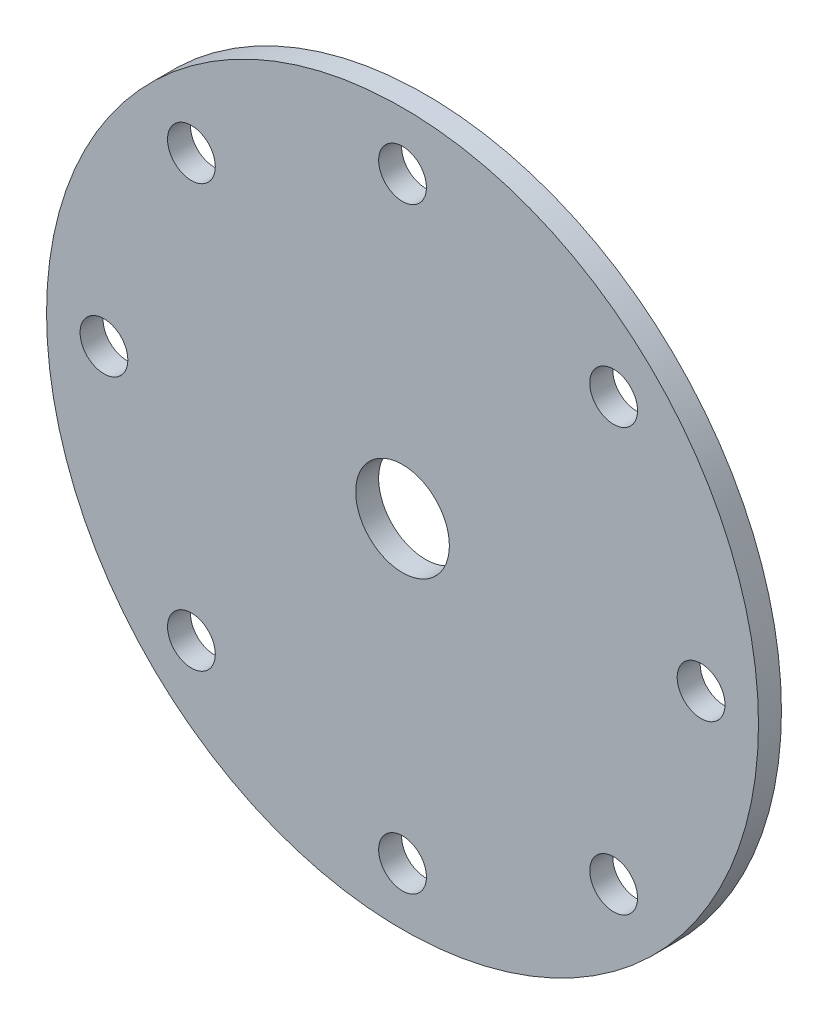
ISO-10303-21;
HEADER;
FILE_DESCRIPTION(('STEP AP214'),'2;1');
FILE_NAME('part.step','',(''),(''),'','','');
FILE_SCHEMA(('AUTOMOTIVE_DESIGN { 1 0 10303 214 1 1 1 1 }'));
ENDSEC;
DATA;
#1=APPLICATION_CONTEXT('core data for automotive mechanical design processes');
#2=APPLICATION_PROTOCOL_DEFINITION('international standard','automotive_design',2000,#1);
#3=PRODUCT_CONTEXT('',#1,'mechanical');
#4=PRODUCT('Part','Part','',(#3));
#5=PRODUCT_RELATED_PRODUCT_CATEGORY('part','',(#4));
#6=PRODUCT_DEFINITION_FORMATION('','',#4);
#7=PRODUCT_DEFINITION_CONTEXT('part definition',#1,'design');
#8=PRODUCT_DEFINITION('design','',#6,#7);
#9=PRODUCT_DEFINITION_SHAPE('','',#8);
#10=(LENGTH_UNIT() NAMED_UNIT(*) SI_UNIT(.MILLI.,.METRE.));
#11=(NAMED_UNIT(*) PLANE_ANGLE_UNIT() SI_UNIT($,.RADIAN.));
#12=(NAMED_UNIT(*) SI_UNIT($,.STERADIAN.) SOLID_ANGLE_UNIT());
#13=UNCERTAINTY_MEASURE_WITH_UNIT(LENGTH_MEASURE(1.E-05),#10,'distance_accuracy_value','');
#14=(GEOMETRIC_REPRESENTATION_CONTEXT(3) GLOBAL_UNCERTAINTY_ASSIGNED_CONTEXT((#13)) GLOBAL_UNIT_ASSIGNED_CONTEXT((#10,
#11,#12)) REPRESENTATION_CONTEXT('',''));
#15=CARTESIAN_POINT('',(0.,0.,0.));
#16=DIRECTION('',(0.,0.,1.));
#17=DIRECTION('',(1.,0.,0.));
#18=AXIS2_PLACEMENT_3D('',#15,#16,#17);
#19=CARTESIAN_POINT('',(0.,0.,6.35));
#20=DIRECTION('',(0.,0.,-1.));
#21=DIRECTION('',(-1.,0.,0.));
#22=AXIS2_PLACEMENT_3D('',#19,#20,#21);
#23=CYLINDRICAL_SURFACE('',#22,12.954);
#24=CARTESIAN_POINT('',(0.,0.,6.35));
#25=DIRECTION('',(0.,0.,1.));
#26=DIRECTION('',(1.,0.,0.));
#27=AXIS2_PLACEMENT_3D('',#24,#25,#26);
#28=CIRCLE('',#27,12.954);
#29=CARTESIAN_POINT('',(12.954,0.,6.35));
#30=VERTEX_POINT('',#29);
#31=EDGE_CURVE('E42',#30,#30,#28,.T.);
#32=ORIENTED_EDGE('',*,*,#31,.T.);
#33=EDGE_LOOP('',(#32));
#34=FACE_BOUND('',#33,.T.);
#35=CARTESIAN_POINT('',(0.,0.,0.));
#36=DIRECTION('',(0.,0.,1.));
#37=DIRECTION('',(1.,0.,0.));
#38=AXIS2_PLACEMENT_3D('',#35,#36,#37);
#39=CIRCLE('',#38,12.954);
#40=CARTESIAN_POINT('',(12.954,0.,0.));
#41=VERTEX_POINT('',#40);
#42=EDGE_CURVE('E74',#41,#41,#39,.T.);
#43=ORIENTED_EDGE('',*,*,#42,.F.);
#44=EDGE_LOOP('',(#43));
#45=FACE_BOUND('',#44,.T.);
#46=ADVANCED_FACE('F34',(#34,#45),#23,.F.);
#47=CARTESIAN_POINT('',(0.,82.55,6.35));
#48=DIRECTION('',(0.,0.,-1.));
#49=DIRECTION('',(-1.,0.,0.));
#50=AXIS2_PLACEMENT_3D('',#47,#48,#49);
#51=CYLINDRICAL_SURFACE('',#50,6.604);
#52=CARTESIAN_POINT('',(0.,82.55,6.35));
#53=DIRECTION('',(0.,0.,1.));
#54=DIRECTION('',(1.,0.,0.));
#55=AXIS2_PLACEMENT_3D('',#52,#53,#54);
#56=CIRCLE('',#55,6.604);
#57=CARTESIAN_POINT('',(6.604,82.55,6.35));
#58=VERTEX_POINT('',#57);
#59=EDGE_CURVE('E47',#58,#58,#56,.T.);
#60=ORIENTED_EDGE('',*,*,#59,.T.);
#61=EDGE_LOOP('',(#60));
#62=FACE_BOUND('',#61,.T.);
#63=CARTESIAN_POINT('',(0.,82.55,0.));
#64=DIRECTION('',(0.,0.,1.));
#65=DIRECTION('',(1.,0.,0.));
#66=AXIS2_PLACEMENT_3D('',#63,#64,#65);
#67=CIRCLE('',#66,6.604);
#68=CARTESIAN_POINT('',(6.604,82.55,0.));
#69=VERTEX_POINT('',#68);
#70=EDGE_CURVE('E72',#69,#69,#67,.T.);
#71=ORIENTED_EDGE('',*,*,#70,.F.);
#72=EDGE_LOOP('',(#71));
#73=FACE_BOUND('',#72,.T.);
#74=ADVANCED_FACE('F107',(#62,#73),#51,.F.);
#75=CARTESIAN_POINT('',(58.3716647869495,58.3716647869495,6.35));
#76=DIRECTION('',(0.,0.,-1.));
#77=DIRECTION('',(-1.,0.,0.));
#78=AXIS2_PLACEMENT_3D('',#75,#76,#77);
#79=CYLINDRICAL_SURFACE('',#78,6.604);
#80=CARTESIAN_POINT('',(58.3716647869495,58.3716647869495,6.35));
#81=DIRECTION('',(0.,0.,1.));
#82=DIRECTION('',(1.,0.,0.));
#83=AXIS2_PLACEMENT_3D('',#80,#81,#82);
#84=CIRCLE('',#83,6.604);
#85=CARTESIAN_POINT('',(64.9756647869495,58.3716647869495,6.35));
#86=VERTEX_POINT('',#85);
#87=EDGE_CURVE('E102',#86,#86,#84,.T.);
#88=ORIENTED_EDGE('',*,*,#87,.T.);
#89=EDGE_LOOP('',(#88));
#90=FACE_BOUND('',#89,.T.);
#91=CARTESIAN_POINT('',(58.3716647869495,58.3716647869495,0.));
#92=DIRECTION('',(0.,0.,1.));
#93=DIRECTION('',(1.,0.,0.));
#94=AXIS2_PLACEMENT_3D('',#91,#92,#93);
#95=CIRCLE('',#94,6.604);
#96=CARTESIAN_POINT('',(64.9756647869495,58.3716647869495,0.));
#97=VERTEX_POINT('',#96);
#98=EDGE_CURVE('E69',#97,#97,#95,.T.);
#99=ORIENTED_EDGE('',*,*,#98,.F.);
#100=EDGE_LOOP('',(#99));
#101=FACE_BOUND('',#100,.T.);
#102=ADVANCED_FACE('F125',(#90,#101),#79,.F.);
#103=CARTESIAN_POINT('',(82.55,0.,6.35));
#104=DIRECTION('',(0.,0.,-1.));
#105=DIRECTION('',(-1.,0.,0.));
#106=AXIS2_PLACEMENT_3D('',#103,#104,#105);
#107=CYLINDRICAL_SURFACE('',#106,6.604);
#108=CARTESIAN_POINT('',(82.55,0.,6.35));
#109=DIRECTION('',(0.,0.,1.));
#110=DIRECTION('',(1.,0.,0.));
#111=AXIS2_PLACEMENT_3D('',#108,#109,#110);
#112=CIRCLE('',#111,6.604);
#113=CARTESIAN_POINT('',(89.154,0.,6.35));
#114=VERTEX_POINT('',#113);
#115=EDGE_CURVE('E99',#114,#114,#112,.T.);
#116=ORIENTED_EDGE('',*,*,#115,.T.);
#117=EDGE_LOOP('',(#116));
#118=FACE_BOUND('',#117,.T.);
#119=CARTESIAN_POINT('',(82.55,0.,0.));
#120=DIRECTION('',(0.,0.,1.));
#121=DIRECTION('',(1.,0.,0.));
#122=AXIS2_PLACEMENT_3D('',#119,#120,#121);
#123=CIRCLE('',#122,6.604);
#124=CARTESIAN_POINT('',(89.154,0.,0.));
#125=VERTEX_POINT('',#124);
#126=EDGE_CURVE('E66',#125,#125,#123,.T.);
#127=ORIENTED_EDGE('',*,*,#126,.F.);
#128=EDGE_LOOP('',(#127));
#129=FACE_BOUND('',#128,.T.);
#130=ADVANCED_FACE('F132',(#118,#129),#107,.F.);
#131=CARTESIAN_POINT('',(58.3716647869495,-58.3716647869495,6.35));
#132=DIRECTION('',(0.,0.,-1.));
#133=DIRECTION('',(-1.,0.,0.));
#134=AXIS2_PLACEMENT_3D('',#131,#132,#133);
#135=CYLINDRICAL_SURFACE('',#134,6.604);
#136=CARTESIAN_POINT('',(58.3716647869495,-58.3716647869495,6.35));
#137=DIRECTION('',(0.,0.,1.));
#138=DIRECTION('',(1.,0.,0.));
#139=AXIS2_PLACEMENT_3D('',#136,#137,#138);
#140=CIRCLE('',#139,6.604);
#141=CARTESIAN_POINT('',(64.9756647869495,-58.3716647869495,6.35));
#142=VERTEX_POINT('',#141);
#143=EDGE_CURVE('E96',#142,#142,#140,.T.);
#144=ORIENTED_EDGE('',*,*,#143,.T.);
#145=EDGE_LOOP('',(#144));
#146=FACE_BOUND('',#145,.T.);
#147=CARTESIAN_POINT('',(58.3716647869495,-58.3716647869495,0.));
#148=DIRECTION('',(0.,0.,1.));
#149=DIRECTION('',(1.,0.,0.));
#150=AXIS2_PLACEMENT_3D('',#147,#148,#149);
#151=CIRCLE('',#150,6.604);
#152=CARTESIAN_POINT('',(64.9756647869495,-58.3716647869495,0.));
#153=VERTEX_POINT('',#152);
#154=EDGE_CURVE('E63',#153,#153,#151,.T.);
#155=ORIENTED_EDGE('',*,*,#154,.F.);
#156=EDGE_LOOP('',(#155));
#157=FACE_BOUND('',#156,.T.);
#158=ADVANCED_FACE('F136',(#146,#157),#135,.F.);
#159=CARTESIAN_POINT('',(0.,-82.55,6.35));
#160=DIRECTION('',(0.,0.,-1.));
#161=DIRECTION('',(-1.,0.,0.));
#162=AXIS2_PLACEMENT_3D('',#159,#160,#161);
#163=CYLINDRICAL_SURFACE('',#162,6.604);
#164=CARTESIAN_POINT('',(0.,-82.55,6.35));
#165=DIRECTION('',(0.,0.,1.));
#166=DIRECTION('',(1.,0.,0.));
#167=AXIS2_PLACEMENT_3D('',#164,#165,#166);
#168=CIRCLE('',#167,6.604);
#169=CARTESIAN_POINT('',(6.60400000000002,-82.55,6.35));
#170=VERTEX_POINT('',#169);
#171=EDGE_CURVE('E93',#170,#170,#168,.T.);
#172=ORIENTED_EDGE('',*,*,#171,.T.);
#173=EDGE_LOOP('',(#172));
#174=FACE_BOUND('',#173,.T.);
#175=CARTESIAN_POINT('',(0.,-82.55,0.));
#176=DIRECTION('',(0.,0.,1.));
#177=DIRECTION('',(1.,0.,0.));
#178=AXIS2_PLACEMENT_3D('',#175,#176,#177);
#179=CIRCLE('',#178,6.604);
#180=CARTESIAN_POINT('',(6.60400000000002,-82.55,0.));
#181=VERTEX_POINT('',#180);
#182=EDGE_CURVE('E60',#181,#181,#179,.T.);
#183=ORIENTED_EDGE('',*,*,#182,.F.);
#184=EDGE_LOOP('',(#183));
#185=FACE_BOUND('',#184,.T.);
#186=ADVANCED_FACE('F140',(#174,#185),#163,.F.);
#187=CARTESIAN_POINT('',(-58.3716647869495,-58.3716647869495,6.35));
#188=DIRECTION('',(0.,0.,-1.));
#189=DIRECTION('',(-1.,0.,0.));
#190=AXIS2_PLACEMENT_3D('',#187,#188,#189);
#191=CYLINDRICAL_SURFACE('',#190,6.604);
#192=CARTESIAN_POINT('',(-58.3716647869495,-58.3716647869495,6.35));
#193=DIRECTION('',(0.,0.,1.));
#194=DIRECTION('',(1.,0.,0.));
#195=AXIS2_PLACEMENT_3D('',#192,#193,#194);
#196=CIRCLE('',#195,6.604);
#197=CARTESIAN_POINT('',(-51.7676647869495,-58.3716647869495,6.35));
#198=VERTEX_POINT('',#197);
#199=EDGE_CURVE('E88',#198,#198,#196,.T.);
#200=ORIENTED_EDGE('',*,*,#199,.T.);
#201=EDGE_LOOP('',(#200));
#202=FACE_BOUND('',#201,.T.);
#203=CARTESIAN_POINT('',(-58.3716647869495,-58.3716647869495,0.));
#204=DIRECTION('',(0.,0.,1.));
#205=DIRECTION('',(1.,0.,0.));
#206=AXIS2_PLACEMENT_3D('',#203,#204,#205);
#207=CIRCLE('',#206,6.604);
#208=CARTESIAN_POINT('',(-51.7676647869495,-58.3716647869495,0.));
#209=VERTEX_POINT('',#208);
#210=EDGE_CURVE('E57',#209,#209,#207,.T.);
#211=ORIENTED_EDGE('',*,*,#210,.F.);
#212=EDGE_LOOP('',(#211));
#213=FACE_BOUND('',#212,.T.);
#214=ADVANCED_FACE('F144',(#202,#213),#191,.F.);
#215=CARTESIAN_POINT('',(-82.55,0.,6.35));
#216=DIRECTION('',(0.,0.,-1.));
#217=DIRECTION('',(-1.,0.,0.));
#218=AXIS2_PLACEMENT_3D('',#215,#216,#217);
#219=CYLINDRICAL_SURFACE('',#218,6.604);
#220=CARTESIAN_POINT('',(-82.55,0.,6.35));
#221=DIRECTION('',(0.,0.,1.));
#222=DIRECTION('',(1.,0.,0.));
#223=AXIS2_PLACEMENT_3D('',#220,#221,#222);
#224=CIRCLE('',#223,6.604);
#225=CARTESIAN_POINT('',(-75.946,0.,6.35));
#226=VERTEX_POINT('',#225);
#227=EDGE_CURVE('E83',#226,#226,#224,.T.);
#228=ORIENTED_EDGE('',*,*,#227,.T.);
#229=EDGE_LOOP('',(#228));
#230=FACE_BOUND('',#229,.T.);
#231=CARTESIAN_POINT('',(-82.55,0.,0.));
#232=DIRECTION('',(0.,0.,1.));
#233=DIRECTION('',(1.,0.,0.));
#234=AXIS2_PLACEMENT_3D('',#231,#232,#233);
#235=CIRCLE('',#234,6.604);
#236=CARTESIAN_POINT('',(-75.946,0.,0.));
#237=VERTEX_POINT('',#236);
#238=EDGE_CURVE('E54',#237,#237,#235,.T.);
#239=ORIENTED_EDGE('',*,*,#238,.F.);
#240=EDGE_LOOP('',(#239));
#241=FACE_BOUND('',#240,.T.);
#242=ADVANCED_FACE('F147',(#230,#241),#219,.F.);
#243=CARTESIAN_POINT('',(-58.3716647869495,58.3716647869495,6.35));
#244=DIRECTION('',(0.,0.,-1.));
#245=DIRECTION('',(-1.,0.,0.));
#246=AXIS2_PLACEMENT_3D('',#243,#244,#245);
#247=CYLINDRICAL_SURFACE('',#246,6.604);
#248=CARTESIAN_POINT('',(-58.3716647869495,58.3716647869495,6.35));
#249=DIRECTION('',(0.,0.,1.));
#250=DIRECTION('',(1.,0.,0.));
#251=AXIS2_PLACEMENT_3D('',#248,#249,#250);
#252=CIRCLE('',#251,6.604);
#253=CARTESIAN_POINT('',(-51.7676647869495,58.3716647869495,6.35));
#254=VERTEX_POINT('',#253);
#255=EDGE_CURVE('E79',#254,#254,#252,.T.);
#256=ORIENTED_EDGE('',*,*,#255,.T.);
#257=EDGE_LOOP('',(#256));
#258=FACE_BOUND('',#257,.T.);
#259=CARTESIAN_POINT('',(-58.3716647869495,58.3716647869495,0.));
#260=DIRECTION('',(0.,0.,1.));
#261=DIRECTION('',(1.,0.,0.));
#262=AXIS2_PLACEMENT_3D('',#259,#260,#261);
#263=CIRCLE('',#262,6.604);
#264=CARTESIAN_POINT('',(-51.7676647869495,58.3716647869495,0.));
#265=VERTEX_POINT('',#264);
#266=EDGE_CURVE('E51',#265,#265,#263,.T.);
#267=ORIENTED_EDGE('',*,*,#266,.F.);
#268=EDGE_LOOP('',(#267));
#269=FACE_BOUND('',#268,.T.);
#270=ADVANCED_FACE('F36',(#258,#269),#247,.F.);
#271=CARTESIAN_POINT('',(0.,0.,6.35));
#272=DIRECTION('',(0.,0.,-1.));
#273=DIRECTION('',(-1.,0.,0.));
#274=AXIS2_PLACEMENT_3D('',#271,#272,#273);
#275=CYLINDRICAL_SURFACE('',#274,98.425);
#276=CARTESIAN_POINT('',(0.,0.,6.35));
#277=DIRECTION('',(0.,0.,1.));
#278=DIRECTION('',(1.,0.,0.));
#279=AXIS2_PLACEMENT_3D('',#276,#277,#278);
#280=CIRCLE('',#279,98.425);
#281=CARTESIAN_POINT('',(98.425,0.,6.35));
#282=VERTEX_POINT('',#281);
#283=EDGE_CURVE('E10',#282,#282,#280,.T.);
#284=ORIENTED_EDGE('',*,*,#283,.F.);
#285=EDGE_LOOP('',(#284));
#286=FACE_BOUND('',#285,.T.);
#287=CARTESIAN_POINT('',(0.,0.,0.));
#288=DIRECTION('',(0.,0.,1.));
#289=DIRECTION('',(1.,0.,0.));
#290=AXIS2_PLACEMENT_3D('',#287,#288,#289);
#291=CIRCLE('',#290,98.425);
#292=CARTESIAN_POINT('',(98.425,0.,0.));
#293=VERTEX_POINT('',#292);
#294=EDGE_CURVE('E38',#293,#293,#291,.T.);
#295=ORIENTED_EDGE('',*,*,#294,.T.);
#296=EDGE_LOOP('',(#295));
#297=FACE_BOUND('',#296,.T.);
#298=ADVANCED_FACE('F114',(#286,#297),#275,.T.);
#299=CARTESIAN_POINT('',(0.,0.,6.35));
#300=DIRECTION('',(0.,0.,1.));
#301=DIRECTION('',(1.,0.,0.));
#302=AXIS2_PLACEMENT_3D('',#299,#300,#301);
#303=PLANE('',#302);
#304=ORIENTED_EDGE('',*,*,#255,.F.);
#305=EDGE_LOOP('',(#304));
#306=FACE_BOUND('',#305,.T.);
#307=ORIENTED_EDGE('',*,*,#227,.F.);
#308=EDGE_LOOP('',(#307));
#309=FACE_BOUND('',#308,.T.);
#310=ORIENTED_EDGE('',*,*,#199,.F.);
#311=EDGE_LOOP('',(#310));
#312=FACE_BOUND('',#311,.T.);
#313=ORIENTED_EDGE('',*,*,#171,.F.);
#314=EDGE_LOOP('',(#313));
#315=FACE_BOUND('',#314,.T.);
#316=ORIENTED_EDGE('',*,*,#143,.F.);
#317=EDGE_LOOP('',(#316));
#318=FACE_BOUND('',#317,.T.);
#319=ORIENTED_EDGE('',*,*,#115,.F.);
#320=EDGE_LOOP('',(#319));
#321=FACE_BOUND('',#320,.T.);
#322=ORIENTED_EDGE('',*,*,#87,.F.);
#323=EDGE_LOOP('',(#322));
#324=FACE_BOUND('',#323,.T.);
#325=ORIENTED_EDGE('',*,*,#59,.F.);
#326=EDGE_LOOP('',(#325));
#327=FACE_BOUND('',#326,.T.);
#328=ORIENTED_EDGE('',*,*,#31,.F.);
#329=EDGE_LOOP('',(#328));
#330=FACE_BOUND('',#329,.T.);
#331=ORIENTED_EDGE('',*,*,#283,.T.);
#332=EDGE_LOOP('',(#331));
#333=FACE_BOUND('',#332,.T.);
#334=ADVANCED_FACE('F110',(#306,#309,#312,#315,#318,#321,#324,#327,#330,#333),#303,.T.);
#335=CARTESIAN_POINT('',(0.,0.,0.));
#336=DIRECTION('',(0.,0.,1.));
#337=DIRECTION('',(1.,0.,0.));
#338=AXIS2_PLACEMENT_3D('',#335,#336,#337);
#339=PLANE('',#338);
#340=ORIENTED_EDGE('',*,*,#266,.T.);
#341=EDGE_LOOP('',(#340));
#342=FACE_BOUND('',#341,.T.);
#343=ORIENTED_EDGE('',*,*,#238,.T.);
#344=EDGE_LOOP('',(#343));
#345=FACE_BOUND('',#344,.T.);
#346=ORIENTED_EDGE('',*,*,#210,.T.);
#347=EDGE_LOOP('',(#346));
#348=FACE_BOUND('',#347,.T.);
#349=ORIENTED_EDGE('',*,*,#182,.T.);
#350=EDGE_LOOP('',(#349));
#351=FACE_BOUND('',#350,.T.);
#352=ORIENTED_EDGE('',*,*,#154,.T.);
#353=EDGE_LOOP('',(#352));
#354=FACE_BOUND('',#353,.T.);
#355=ORIENTED_EDGE('',*,*,#126,.T.);
#356=EDGE_LOOP('',(#355));
#357=FACE_BOUND('',#356,.T.);
#358=ORIENTED_EDGE('',*,*,#98,.T.);
#359=EDGE_LOOP('',(#358));
#360=FACE_BOUND('',#359,.T.);
#361=ORIENTED_EDGE('',*,*,#70,.T.);
#362=EDGE_LOOP('',(#361));
#363=FACE_BOUND('',#362,.T.);
#364=ORIENTED_EDGE('',*,*,#42,.T.);
#365=EDGE_LOOP('',(#364));
#366=FACE_BOUND('',#365,.T.);
#367=ORIENTED_EDGE('',*,*,#294,.F.);
#368=EDGE_LOOP('',(#367));
#369=FACE_BOUND('',#368,.T.);
#370=ADVANCED_FACE('F113',(#342,#345,#348,#351,#354,#357,#360,#363,#366,#369),#339,.F.);
#371=CLOSED_SHELL('',(#46,#74,#102,#130,#158,#186,#214,#242,#270,#298,#334,#370));
#372=MANIFOLD_SOLID_BREP('B2',#371);
#373=ADVANCED_BREP_SHAPE_REPRESENTATION('',(#18,#372),#14);
#374=SHAPE_DEFINITION_REPRESENTATION(#9,#373);
ENDSEC;
END-ISO-10303-21;
